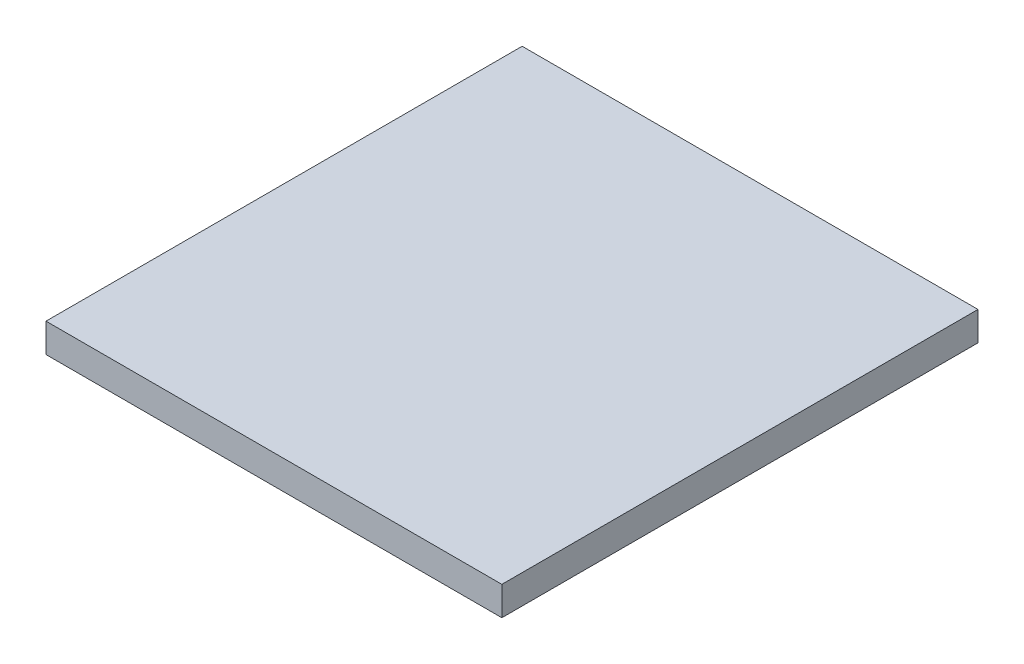
ISO-10303-21;
HEADER;
FILE_DESCRIPTION(('STEP AP214'),'2;1');
FILE_NAME('part.step','',(''),(''),'','','');
FILE_SCHEMA(('AUTOMOTIVE_DESIGN { 1 0 10303 214 1 1 1 1 }'));
ENDSEC;
DATA;
#1=APPLICATION_CONTEXT('core data for automotive mechanical design processes');
#2=APPLICATION_PROTOCOL_DEFINITION('international standard','automotive_design',2000,#1);
#3=PRODUCT_CONTEXT('',#1,'mechanical');
#4=PRODUCT('Part','Part','',(#3));
#5=PRODUCT_RELATED_PRODUCT_CATEGORY('part','',(#4));
#6=PRODUCT_DEFINITION_FORMATION('','',#4);
#7=PRODUCT_DEFINITION_CONTEXT('part definition',#1,'design');
#8=PRODUCT_DEFINITION('design','',#6,#7);
#9=PRODUCT_DEFINITION_SHAPE('','',#8);
#10=(LENGTH_UNIT() NAMED_UNIT(*) SI_UNIT(.MILLI.,.METRE.));
#11=(NAMED_UNIT(*) PLANE_ANGLE_UNIT() SI_UNIT($,.RADIAN.));
#12=(NAMED_UNIT(*) SI_UNIT($,.STERADIAN.) SOLID_ANGLE_UNIT());
#13=UNCERTAINTY_MEASURE_WITH_UNIT(LENGTH_MEASURE(1.E-05),#10,'distance_accuracy_value','');
#14=(GEOMETRIC_REPRESENTATION_CONTEXT(3) GLOBAL_UNCERTAINTY_ASSIGNED_CONTEXT((#13)) GLOBAL_UNIT_ASSIGNED_CONTEXT((#10,
#11,#12)) REPRESENTATION_CONTEXT('',''));
#15=CARTESIAN_POINT('',(0.,0.,0.));
#16=DIRECTION('',(0.,0.,1.));
#17=DIRECTION('',(1.,0.,0.));
#18=AXIS2_PLACEMENT_3D('',#15,#16,#17);
#19=CARTESIAN_POINT('',(300.,38.1,313.355));
#20=DIRECTION('',(-1.,0.,0.));
#21=DIRECTION('',(0.,0.,1.));
#22=AXIS2_PLACEMENT_3D('',#19,#20,#21);
#23=PLANE('',#22);
#24=DIRECTION('',(0.,0.,-1.));
#25=VECTOR('',#24,1.);
#26=CARTESIAN_POINT('',(300.,0.,313.355));
#27=LINE('',#26,#25);
#28=CARTESIAN_POINT('',(300.,0.,313.355));
#29=VERTEX_POINT('',#28);
#30=CARTESIAN_POINT('',(300.,0.,-313.355));
#31=VERTEX_POINT('',#30);
#32=EDGE_CURVE('E107',#29,#31,#27,.T.);
#33=ORIENTED_EDGE('',*,*,#32,.T.);
#34=DIRECTION('',(0.,-1.,0.));
#35=VECTOR('',#34,1.);
#36=CARTESIAN_POINT('',(300.,38.1,-313.355));
#37=LINE('',#36,#35);
#38=CARTESIAN_POINT('',(300.,38.1,-313.355));
#39=VERTEX_POINT('',#38);
#40=EDGE_CURVE('E11',#39,#31,#37,.T.);
#41=ORIENTED_EDGE('',*,*,#40,.F.);
#42=DIRECTION('',(0.,0.,-1.));
#43=VECTOR('',#42,1.);
#44=CARTESIAN_POINT('',(300.,38.1,313.355));
#45=LINE('',#44,#43);
#46=CARTESIAN_POINT('',(300.,38.1,313.355));
#47=VERTEX_POINT('',#46);
#48=EDGE_CURVE('E91',#47,#39,#45,.T.);
#49=ORIENTED_EDGE('',*,*,#48,.F.);
#50=DIRECTION('',(0.,-1.,0.));
#51=VECTOR('',#50,1.);
#52=CARTESIAN_POINT('',(300.,38.1,313.355));
#53=LINE('',#52,#51);
#54=EDGE_CURVE('E103',#47,#29,#53,.T.);
#55=ORIENTED_EDGE('',*,*,#54,.T.);
#56=EDGE_LOOP('',(#33,#41,#49,#55));
#57=FACE_BOUND('',#56,.T.);
#58=ADVANCED_FACE('F39',(#57),#23,.F.);
#59=CARTESIAN_POINT('',(-300.,38.1,-313.355));
#60=DIRECTION('',(0.,0.,1.));
#61=DIRECTION('',(1.,0.,0.));
#62=AXIS2_PLACEMENT_3D('',#59,#60,#61);
#63=PLANE('',#62);
#64=DIRECTION('',(-1.,0.,0.));
#65=VECTOR('',#64,1.);
#66=CARTESIAN_POINT('',(-300.,0.,-313.355));
#67=LINE('',#66,#65);
#68=CARTESIAN_POINT('',(-300.,0.,-313.355));
#69=VERTEX_POINT('',#68);
#70=EDGE_CURVE('E96',#31,#69,#67,.T.);
#71=ORIENTED_EDGE('',*,*,#70,.T.);
#72=DIRECTION('',(0.,-1.,0.));
#73=VECTOR('',#72,1.);
#74=CARTESIAN_POINT('',(-300.,38.1,-313.355));
#75=LINE('',#74,#73);
#76=CARTESIAN_POINT('',(-300.,38.1,-313.355));
#77=VERTEX_POINT('',#76);
#78=EDGE_CURVE('E48',#77,#69,#75,.T.);
#79=ORIENTED_EDGE('',*,*,#78,.F.);
#80=DIRECTION('',(-1.,0.,0.));
#81=VECTOR('',#80,1.);
#82=CARTESIAN_POINT('',(-300.,38.1,-313.355));
#83=LINE('',#82,#81);
#84=EDGE_CURVE('E86',#39,#77,#83,.T.);
#85=ORIENTED_EDGE('',*,*,#84,.F.);
#86=ORIENTED_EDGE('',*,*,#40,.T.);
#87=EDGE_LOOP('',(#71,#79,#85,#86));
#88=FACE_BOUND('',#87,.T.);
#89=ADVANCED_FACE('F95',(#88),#63,.F.);
#90=CARTESIAN_POINT('',(-300.,38.1,-313.355));
#91=DIRECTION('',(1.,0.,0.));
#92=DIRECTION('',(0.,0.,-1.));
#93=AXIS2_PLACEMENT_3D('',#90,#91,#92);
#94=PLANE('',#93);
#95=DIRECTION('',(0.,0.,1.));
#96=VECTOR('',#95,1.);
#97=CARTESIAN_POINT('',(-300.,0.,-313.355));
#98=LINE('',#97,#96);
#99=CARTESIAN_POINT('',(-300.,0.,313.355));
#100=VERTEX_POINT('',#99);
#101=EDGE_CURVE('E73',#69,#100,#98,.T.);
#102=ORIENTED_EDGE('',*,*,#101,.T.);
#103=DIRECTION('',(0.,-1.,0.));
#104=VECTOR('',#103,1.);
#105=CARTESIAN_POINT('',(-300.,38.1,313.355));
#106=LINE('',#105,#104);
#107=CARTESIAN_POINT('',(-300.,38.1,313.355));
#108=VERTEX_POINT('',#107);
#109=EDGE_CURVE('E98',#108,#100,#106,.T.);
#110=ORIENTED_EDGE('',*,*,#109,.F.);
#111=DIRECTION('',(0.,0.,1.));
#112=VECTOR('',#111,1.);
#113=CARTESIAN_POINT('',(-300.,38.1,-313.355));
#114=LINE('',#113,#112);
#115=EDGE_CURVE('E89',#77,#108,#114,.T.);
#116=ORIENTED_EDGE('',*,*,#115,.F.);
#117=ORIENTED_EDGE('',*,*,#78,.T.);
#118=EDGE_LOOP('',(#102,#110,#116,#117));
#119=FACE_BOUND('',#118,.T.);
#120=ADVANCED_FACE('F99',(#119),#94,.F.);
#121=CARTESIAN_POINT('',(-300.,38.1,313.355));
#122=DIRECTION('',(0.,0.,-1.));
#123=DIRECTION('',(-1.,0.,0.));
#124=AXIS2_PLACEMENT_3D('',#121,#122,#123);
#125=PLANE('',#124);
#126=DIRECTION('',(1.,0.,0.));
#127=VECTOR('',#126,1.);
#128=CARTESIAN_POINT('',(-300.,0.,313.355));
#129=LINE('',#128,#127);
#130=EDGE_CURVE('E79',#100,#29,#129,.T.);
#131=ORIENTED_EDGE('',*,*,#130,.T.);
#132=ORIENTED_EDGE('',*,*,#54,.F.);
#133=DIRECTION('',(1.,0.,0.));
#134=VECTOR('',#133,1.);
#135=CARTESIAN_POINT('',(-300.,38.1,313.355));
#136=LINE('',#135,#134);
#137=EDGE_CURVE('E56',#108,#47,#136,.T.);
#138=ORIENTED_EDGE('',*,*,#137,.F.);
#139=ORIENTED_EDGE('',*,*,#109,.T.);
#140=EDGE_LOOP('',(#131,#132,#138,#139));
#141=FACE_BOUND('',#140,.T.);
#142=ADVANCED_FACE('F120',(#141),#125,.F.);
#143=CARTESIAN_POINT('',(0.,38.1,0.));
#144=DIRECTION('',(0.,-1.,0.));
#145=DIRECTION('',(0.,0.,-1.));
#146=AXIS2_PLACEMENT_3D('',#143,#144,#145);
#147=PLANE('',#146);
#148=ORIENTED_EDGE('',*,*,#48,.T.);
#149=ORIENTED_EDGE('',*,*,#84,.T.);
#150=ORIENTED_EDGE('',*,*,#115,.T.);
#151=ORIENTED_EDGE('',*,*,#137,.T.);
#152=EDGE_LOOP('',(#148,#149,#150,#151));
#153=FACE_BOUND('',#152,.T.);
#154=ADVANCED_FACE('F87',(#153),#147,.F.);
#155=CARTESIAN_POINT('',(0.,0.,0.));
#156=DIRECTION('',(0.,-1.,0.));
#157=DIRECTION('',(0.,0.,-1.));
#158=AXIS2_PLACEMENT_3D('',#155,#156,#157);
#159=PLANE('',#158);
#160=ORIENTED_EDGE('',*,*,#32,.F.);
#161=ORIENTED_EDGE('',*,*,#130,.F.);
#162=ORIENTED_EDGE('',*,*,#101,.F.);
#163=ORIENTED_EDGE('',*,*,#70,.F.);
#164=EDGE_LOOP('',(#160,#161,#162,#163));
#165=FACE_BOUND('',#164,.T.);
#166=ADVANCED_FACE('F123',(#165),#159,.T.);
#167=CLOSED_SHELL('',(#58,#89,#120,#142,#154,#166));
#168=MANIFOLD_SOLID_BREP('B2',#167);
#169=ADVANCED_BREP_SHAPE_REPRESENTATION('',(#18,#168),#14);
#170=SHAPE_DEFINITION_REPRESENTATION(#9,#169);
ENDSEC;
END-ISO-10303-21;
